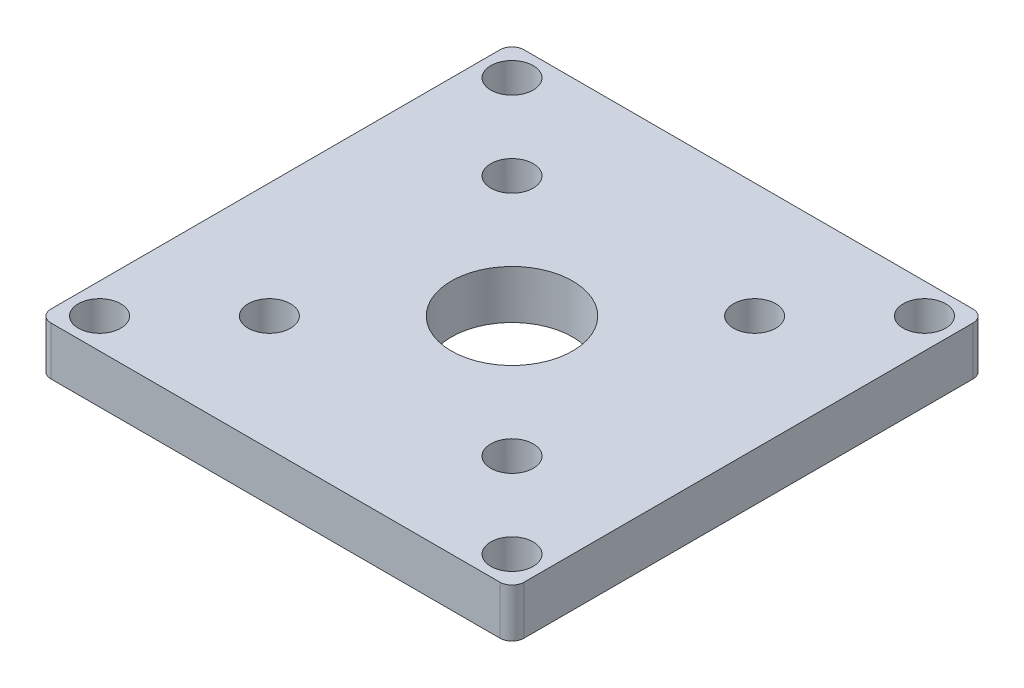
ISO-10303-21;
HEADER;
FILE_DESCRIPTION(('STEP AP214'),'2;1');
FILE_NAME('part.step','',(''),(''),'','','');
FILE_SCHEMA(('AUTOMOTIVE_DESIGN { 1 0 10303 214 1 1 1 1 }'));
ENDSEC;
DATA;
#1=APPLICATION_CONTEXT('core data for automotive mechanical design processes');
#2=APPLICATION_PROTOCOL_DEFINITION('international standard','automotive_design',2000,#1);
#3=PRODUCT_CONTEXT('',#1,'mechanical');
#4=PRODUCT('Part','Part','',(#3));
#5=PRODUCT_RELATED_PRODUCT_CATEGORY('part','',(#4));
#6=PRODUCT_DEFINITION_FORMATION('','',#4);
#7=PRODUCT_DEFINITION_CONTEXT('part definition',#1,'design');
#8=PRODUCT_DEFINITION('design','',#6,#7);
#9=PRODUCT_DEFINITION_SHAPE('','',#8);
#10=(LENGTH_UNIT() NAMED_UNIT(*) SI_UNIT(.MILLI.,.METRE.));
#11=(NAMED_UNIT(*) PLANE_ANGLE_UNIT() SI_UNIT($,.RADIAN.));
#12=(NAMED_UNIT(*) SI_UNIT($,.STERADIAN.) SOLID_ANGLE_UNIT());
#13=UNCERTAINTY_MEASURE_WITH_UNIT(LENGTH_MEASURE(1.E-05),#10,'distance_accuracy_value','');
#14=(GEOMETRIC_REPRESENTATION_CONTEXT(3) GLOBAL_UNCERTAINTY_ASSIGNED_CONTEXT((#13)) GLOBAL_UNIT_ASSIGNED_CONTEXT((#10,
#11,#12)) REPRESENTATION_CONTEXT('',''));
#15=CARTESIAN_POINT('',(0.,0.,0.));
#16=DIRECTION('',(0.,0.,1.));
#17=DIRECTION('',(1.,0.,0.));
#18=AXIS2_PLACEMENT_3D('',#15,#16,#17);
#19=CARTESIAN_POINT('',(0.,4.,0.));
#20=DIRECTION('',(0.,-1.,0.));
#21=DIRECTION('',(0.,0.,-1.));
#22=AXIS2_PLACEMENT_3D('',#19,#20,#21);
#23=PLANE('',#22);
#24=CARTESIAN_POINT('',(0.,4.,0.));
#25=DIRECTION('',(0.,1.,0.));
#26=DIRECTION('',(0.,0.,1.));
#27=AXIS2_PLACEMENT_3D('',#24,#25,#26);
#28=CIRCLE('',#27,5.);
#29=CARTESIAN_POINT('',(0.,4.,5.));
#30=VERTEX_POINT('',#29);
#31=EDGE_CURVE('E260',#30,#30,#28,.T.);
#32=ORIENTED_EDGE('',*,*,#31,.F.);
#33=EDGE_LOOP('',(#32));
#34=FACE_BOUND('',#33,.T.);
#35=CARTESIAN_POINT('',(-10.,4.,-9.99999999999917));
#36=DIRECTION('',(0.,1.,0.));
#37=DIRECTION('',(0.,0.,1.));
#38=AXIS2_PLACEMENT_3D('',#35,#36,#37);
#39=CIRCLE('',#38,1.75);
#40=CARTESIAN_POINT('',(-10.,4.,-8.24999999999917));
#41=VERTEX_POINT('',#40);
#42=EDGE_CURVE('E255',#41,#41,#39,.T.);
#43=ORIENTED_EDGE('',*,*,#42,.F.);
#44=EDGE_LOOP('',(#43));
#45=FACE_BOUND('',#44,.T.);
#46=CARTESIAN_POINT('',(-9.99999999999917,4.,10.0000000000008));
#47=DIRECTION('',(0.,1.,0.));
#48=DIRECTION('',(0.,0.,1.));
#49=AXIS2_PLACEMENT_3D('',#46,#47,#48);
#50=CIRCLE('',#49,1.75);
#51=CARTESIAN_POINT('',(-9.99999999999917,4.,11.7500000000008));
#52=VERTEX_POINT('',#51);
#53=EDGE_CURVE('E259',#52,#52,#50,.T.);
#54=ORIENTED_EDGE('',*,*,#53,.F.);
#55=EDGE_LOOP('',(#54));
#56=FACE_BOUND('',#55,.T.);
#57=CARTESIAN_POINT('',(10.0000000000008,4.,10.));
#58=DIRECTION('',(0.,1.,0.));
#59=DIRECTION('',(0.,0.,1.));
#60=AXIS2_PLACEMENT_3D('',#57,#58,#59);
#61=CIRCLE('',#60,1.75);
#62=CARTESIAN_POINT('',(10.0000000000008,4.,11.75));
#63=VERTEX_POINT('',#62);
#64=EDGE_CURVE('E254',#63,#63,#61,.T.);
#65=ORIENTED_EDGE('',*,*,#64,.F.);
#66=EDGE_LOOP('',(#65));
#67=FACE_BOUND('',#66,.T.);
#68=CARTESIAN_POINT('',(10.,4.,-10.));
#69=DIRECTION('',(0.,1.,0.));
#70=DIRECTION('',(0.,0.,1.));
#71=AXIS2_PLACEMENT_3D('',#68,#69,#70);
#72=CIRCLE('',#71,1.75);
#73=CARTESIAN_POINT('',(10.,4.,-8.25));
#74=VERTEX_POINT('',#73);
#75=EDGE_CURVE('E153',#74,#74,#72,.T.);
#76=ORIENTED_EDGE('',*,*,#75,.F.);
#77=EDGE_LOOP('',(#76));
#78=FACE_BOUND('',#77,.T.);
#79=DIRECTION('',(0.,0.,1.));
#80=VECTOR('',#79,1.);
#81=CARTESIAN_POINT('',(-19.5,4.,19.5));
#82=LINE('',#81,#80);
#83=CARTESIAN_POINT('',(-19.5,4.,-18.5));
#84=VERTEX_POINT('',#83);
#85=CARTESIAN_POINT('',(-19.5,4.,18.5));
#86=VERTEX_POINT('',#85);
#87=EDGE_CURVE('E219',#84,#86,#82,.T.);
#88=ORIENTED_EDGE('',*,*,#87,.T.);
#89=CARTESIAN_POINT('',(-18.5,4.,18.5));
#90=DIRECTION('',(0.,-1.,0.));
#91=DIRECTION('',(0.,0.,-1.));
#92=AXIS2_PLACEMENT_3D('',#89,#90,#91);
#93=CIRCLE('',#92,1.);
#94=CARTESIAN_POINT('',(-18.5,4.,19.5));
#95=VERTEX_POINT('',#94);
#96=EDGE_CURVE('E188',#86,#95,#93,.F.);
#97=ORIENTED_EDGE('',*,*,#96,.T.);
#98=DIRECTION('',(1.,0.,0.));
#99=VECTOR('',#98,1.);
#100=CARTESIAN_POINT('',(-19.5,4.,19.5));
#101=LINE('',#100,#99);
#102=CARTESIAN_POINT('',(18.5,4.,19.5));
#103=VERTEX_POINT('',#102);
#104=EDGE_CURVE('E128',#95,#103,#101,.T.);
#105=ORIENTED_EDGE('',*,*,#104,.T.);
#106=CARTESIAN_POINT('',(18.5,4.,18.5));
#107=DIRECTION('',(0.,-1.,0.));
#108=DIRECTION('',(0.,0.,-1.));
#109=AXIS2_PLACEMENT_3D('',#106,#107,#108);
#110=CIRCLE('',#109,1.);
#111=CARTESIAN_POINT('',(19.5,4.,18.5));
#112=VERTEX_POINT('',#111);
#113=EDGE_CURVE('E180',#103,#112,#110,.F.);
#114=ORIENTED_EDGE('',*,*,#113,.T.);
#115=DIRECTION('',(0.,0.,-1.));
#116=VECTOR('',#115,1.);
#117=CARTESIAN_POINT('',(19.5,4.,19.5));
#118=LINE('',#117,#116);
#119=CARTESIAN_POINT('',(19.5,4.,-18.5));
#120=VERTEX_POINT('',#119);
#121=EDGE_CURVE('E137',#112,#120,#118,.T.);
#122=ORIENTED_EDGE('',*,*,#121,.T.);
#123=CARTESIAN_POINT('',(18.5,4.,-18.5));
#124=DIRECTION('',(0.,-1.,0.));
#125=DIRECTION('',(0.,0.,-1.));
#126=AXIS2_PLACEMENT_3D('',#123,#124,#125);
#127=CIRCLE('',#126,1.);
#128=CARTESIAN_POINT('',(18.5,4.,-19.5));
#129=VERTEX_POINT('',#128);
#130=EDGE_CURVE('E63',#120,#129,#127,.F.);
#131=ORIENTED_EDGE('',*,*,#130,.T.);
#132=DIRECTION('',(-1.,0.,0.));
#133=VECTOR('',#132,1.);
#134=CARTESIAN_POINT('',(-19.5,4.,-19.5));
#135=LINE('',#134,#133);
#136=CARTESIAN_POINT('',(-18.5,4.,-19.5));
#137=VERTEX_POINT('',#136);
#138=EDGE_CURVE('E142',#129,#137,#135,.T.);
#139=ORIENTED_EDGE('',*,*,#138,.T.);
#140=CARTESIAN_POINT('',(-18.5,4.,-18.5));
#141=DIRECTION('',(0.,-1.,0.));
#142=DIRECTION('',(0.,0.,-1.));
#143=AXIS2_PLACEMENT_3D('',#140,#141,#142);
#144=CIRCLE('',#143,1.);
#145=EDGE_CURVE('E185',#137,#84,#144,.F.);
#146=ORIENTED_EDGE('',*,*,#145,.T.);
#147=EDGE_LOOP('',(#88,#97,#105,#114,#122,#131,#139,#146));
#148=FACE_BOUND('',#147,.T.);
#149=CARTESIAN_POINT('',(17.,4.,-17.));
#150=DIRECTION('',(0.,1.,0.));
#151=DIRECTION('',(0.,0.,1.));
#152=AXIS2_PLACEMENT_3D('',#149,#150,#151);
#153=CIRCLE('',#152,1.75);
#154=CARTESIAN_POINT('',(17.,4.,-15.25));
#155=VERTEX_POINT('',#154);
#156=EDGE_CURVE('E209',#155,#155,#153,.T.);
#157=ORIENTED_EDGE('',*,*,#156,.F.);
#158=EDGE_LOOP('',(#157));
#159=FACE_BOUND('',#158,.T.);
#160=CARTESIAN_POINT('',(17.0000000000012,4.,17.));
#161=DIRECTION('',(0.,1.,0.));
#162=DIRECTION('',(0.,0.,1.));
#163=AXIS2_PLACEMENT_3D('',#160,#161,#162);
#164=CIRCLE('',#163,1.75);
#165=CARTESIAN_POINT('',(17.0000000000012,4.,18.75));
#166=VERTEX_POINT('',#165);
#167=EDGE_CURVE('E227',#166,#166,#164,.T.);
#168=ORIENTED_EDGE('',*,*,#167,.F.);
#169=EDGE_LOOP('',(#168));
#170=FACE_BOUND('',#169,.T.);
#171=CARTESIAN_POINT('',(-16.9999999999988,4.,17.0000000000012));
#172=DIRECTION('',(0.,1.,0.));
#173=DIRECTION('',(0.,0.,1.));
#174=AXIS2_PLACEMENT_3D('',#171,#172,#173);
#175=CIRCLE('',#174,1.75);
#176=CARTESIAN_POINT('',(-16.9999999999988,4.,18.7500000000012));
#177=VERTEX_POINT('',#176);
#178=EDGE_CURVE('E233',#177,#177,#175,.T.);
#179=ORIENTED_EDGE('',*,*,#178,.F.);
#180=EDGE_LOOP('',(#179));
#181=FACE_BOUND('',#180,.T.);
#182=CARTESIAN_POINT('',(-17.,4.,-16.9999999999988));
#183=DIRECTION('',(0.,1.,0.));
#184=DIRECTION('',(0.,0.,1.));
#185=AXIS2_PLACEMENT_3D('',#182,#183,#184);
#186=CIRCLE('',#185,1.75);
#187=CARTESIAN_POINT('',(-17.,4.,-15.2499999999988));
#188=VERTEX_POINT('',#187);
#189=EDGE_CURVE('E241',#188,#188,#186,.T.);
#190=ORIENTED_EDGE('',*,*,#189,.F.);
#191=EDGE_LOOP('',(#190));
#192=FACE_BOUND('',#191,.T.);
#193=ADVANCED_FACE('F40',(#34,#45,#56,#67,#78,#148,#159,#170,#181,#192),#23,.F.);
#194=CARTESIAN_POINT('',(0.,0.,0.));
#195=DIRECTION('',(0.,-1.,0.));
#196=DIRECTION('',(0.,0.,-1.));
#197=AXIS2_PLACEMENT_3D('',#194,#195,#196);
#198=PLANE('',#197);
#199=CARTESIAN_POINT('',(0.,0.,0.));
#200=DIRECTION('',(0.,-1.,0.));
#201=DIRECTION('',(0.,0.,-1.));
#202=AXIS2_PLACEMENT_3D('',#199,#200,#201);
#203=CIRCLE('',#202,5.);
#204=CARTESIAN_POINT('',(0.,0.,-5.));
#205=VERTEX_POINT('',#204);
#206=EDGE_CURVE('E267',#205,#205,#203,.F.);
#207=ORIENTED_EDGE('',*,*,#206,.T.);
#208=EDGE_LOOP('',(#207));
#209=FACE_BOUND('',#208,.T.);
#210=CARTESIAN_POINT('',(-10.,0.,-9.99999999999917));
#211=DIRECTION('',(0.,-1.,0.));
#212=DIRECTION('',(0.,0.,-1.));
#213=AXIS2_PLACEMENT_3D('',#210,#211,#212);
#214=CIRCLE('',#213,1.75);
#215=CARTESIAN_POINT('',(-10.,0.,-11.7499999999992));
#216=VERTEX_POINT('',#215);
#217=EDGE_CURVE('E161',#216,#216,#214,.T.);
#218=ORIENTED_EDGE('',*,*,#217,.F.);
#219=EDGE_LOOP('',(#218));
#220=FACE_BOUND('',#219,.T.);
#221=CARTESIAN_POINT('',(-9.99999999999917,0.,10.0000000000008));
#222=DIRECTION('',(0.,-1.,0.));
#223=DIRECTION('',(0.,0.,-1.));
#224=AXIS2_PLACEMENT_3D('',#221,#222,#223);
#225=CIRCLE('',#224,1.75);
#226=CARTESIAN_POINT('',(-9.99999999999917,0.,8.25000000000083));
#227=VERTEX_POINT('',#226);
#228=EDGE_CURVE('E157',#227,#227,#225,.T.);
#229=ORIENTED_EDGE('',*,*,#228,.F.);
#230=EDGE_LOOP('',(#229));
#231=FACE_BOUND('',#230,.T.);
#232=CARTESIAN_POINT('',(10.0000000000008,0.,10.));
#233=DIRECTION('',(0.,-1.,0.));
#234=DIRECTION('',(0.,0.,-1.));
#235=AXIS2_PLACEMENT_3D('',#232,#233,#234);
#236=CIRCLE('',#235,1.75);
#237=CARTESIAN_POINT('',(10.0000000000008,0.,8.25000000000001));
#238=VERTEX_POINT('',#237);
#239=EDGE_CURVE('E152',#238,#238,#236,.T.);
#240=ORIENTED_EDGE('',*,*,#239,.F.);
#241=EDGE_LOOP('',(#240));
#242=FACE_BOUND('',#241,.T.);
#243=CARTESIAN_POINT('',(10.,0.,-10.));
#244=DIRECTION('',(0.,-1.,0.));
#245=DIRECTION('',(0.,0.,-1.));
#246=AXIS2_PLACEMENT_3D('',#243,#244,#245);
#247=CIRCLE('',#246,1.75);
#248=CARTESIAN_POINT('',(10.,0.,-11.75));
#249=VERTEX_POINT('',#248);
#250=EDGE_CURVE('E148',#249,#249,#247,.T.);
#251=ORIENTED_EDGE('',*,*,#250,.F.);
#252=EDGE_LOOP('',(#251));
#253=FACE_BOUND('',#252,.T.);
#254=CARTESIAN_POINT('',(-16.9999999999988,0.,17.0000000000012));
#255=DIRECTION('',(0.,1.,0.));
#256=DIRECTION('',(0.,0.,1.));
#257=AXIS2_PLACEMENT_3D('',#254,#255,#256);
#258=CIRCLE('',#257,1.75);
#259=CARTESIAN_POINT('',(-16.9999999999988,0.,18.7500000000012));
#260=VERTEX_POINT('',#259);
#261=EDGE_CURVE('E237',#260,#260,#258,.T.);
#262=ORIENTED_EDGE('',*,*,#261,.T.);
#263=EDGE_LOOP('',(#262));
#264=FACE_BOUND('',#263,.T.);
#265=CARTESIAN_POINT('',(17.,0.,-17.));
#266=DIRECTION('',(0.,1.,0.));
#267=DIRECTION('',(0.,0.,1.));
#268=AXIS2_PLACEMENT_3D('',#265,#266,#267);
#269=CIRCLE('',#268,1.75);
#270=CARTESIAN_POINT('',(17.,0.,-15.25));
#271=VERTEX_POINT('',#270);
#272=EDGE_CURVE('E214',#271,#271,#269,.T.);
#273=ORIENTED_EDGE('',*,*,#272,.T.);
#274=EDGE_LOOP('',(#273));
#275=FACE_BOUND('',#274,.T.);
#276=DIRECTION('',(1.,0.,0.));
#277=VECTOR('',#276,1.);
#278=CARTESIAN_POINT('',(-19.5,0.,19.5));
#279=LINE('',#278,#277);
#280=CARTESIAN_POINT('',(-18.5,0.,19.5));
#281=VERTEX_POINT('',#280);
#282=CARTESIAN_POINT('',(18.5,0.,19.5));
#283=VERTEX_POINT('',#282);
#284=EDGE_CURVE('E125',#281,#283,#279,.T.);
#285=ORIENTED_EDGE('',*,*,#284,.F.);
#286=CARTESIAN_POINT('',(-18.5,0.,18.5));
#287=DIRECTION('',(0.,-1.,0.));
#288=DIRECTION('',(0.,0.,-1.));
#289=AXIS2_PLACEMENT_3D('',#286,#287,#288);
#290=CIRCLE('',#289,1.);
#291=CARTESIAN_POINT('',(-19.5,0.,18.5));
#292=VERTEX_POINT('',#291);
#293=EDGE_CURVE('E107',#281,#292,#290,.T.);
#294=ORIENTED_EDGE('',*,*,#293,.T.);
#295=DIRECTION('',(0.,0.,1.));
#296=VECTOR('',#295,1.);
#297=CARTESIAN_POINT('',(-19.5,0.,19.5));
#298=LINE('',#297,#296);
#299=CARTESIAN_POINT('',(-19.5,0.,-18.5));
#300=VERTEX_POINT('',#299);
#301=EDGE_CURVE('E138',#300,#292,#298,.T.);
#302=ORIENTED_EDGE('',*,*,#301,.F.);
#303=CARTESIAN_POINT('',(-18.5,0.,-18.5));
#304=DIRECTION('',(0.,-1.,0.));
#305=DIRECTION('',(0.,0.,-1.));
#306=AXIS2_PLACEMENT_3D('',#303,#304,#305);
#307=CIRCLE('',#306,1.);
#308=CARTESIAN_POINT('',(-18.5,0.,-19.5));
#309=VERTEX_POINT('',#308);
#310=EDGE_CURVE('E119',#300,#309,#307,.T.);
#311=ORIENTED_EDGE('',*,*,#310,.T.);
#312=DIRECTION('',(-1.,0.,0.));
#313=VECTOR('',#312,1.);
#314=CARTESIAN_POINT('',(-19.5,0.,-19.5));
#315=LINE('',#314,#313);
#316=CARTESIAN_POINT('',(18.5,0.,-19.5));
#317=VERTEX_POINT('',#316);
#318=EDGE_CURVE('E144',#317,#309,#315,.T.);
#319=ORIENTED_EDGE('',*,*,#318,.F.);
#320=CARTESIAN_POINT('',(18.5,0.,-18.5));
#321=DIRECTION('',(0.,-1.,0.));
#322=DIRECTION('',(0.,0.,-1.));
#323=AXIS2_PLACEMENT_3D('',#320,#321,#322);
#324=CIRCLE('',#323,1.);
#325=CARTESIAN_POINT('',(19.5,0.,-18.5));
#326=VERTEX_POINT('',#325);
#327=EDGE_CURVE('E170',#317,#326,#324,.T.);
#328=ORIENTED_EDGE('',*,*,#327,.T.);
#329=DIRECTION('',(0.,0.,-1.));
#330=VECTOR('',#329,1.);
#331=CARTESIAN_POINT('',(19.5,0.,19.5));
#332=LINE('',#331,#330);
#333=CARTESIAN_POINT('',(19.5,0.,18.5));
#334=VERTEX_POINT('',#333);
#335=EDGE_CURVE('E203',#334,#326,#332,.T.);
#336=ORIENTED_EDGE('',*,*,#335,.F.);
#337=CARTESIAN_POINT('',(18.5,0.,18.5));
#338=DIRECTION('',(0.,-1.,0.));
#339=DIRECTION('',(0.,0.,-1.));
#340=AXIS2_PLACEMENT_3D('',#337,#338,#339);
#341=CIRCLE('',#340,1.);
#342=EDGE_CURVE('E130',#334,#283,#341,.T.);
#343=ORIENTED_EDGE('',*,*,#342,.T.);
#344=EDGE_LOOP('',(#285,#294,#302,#311,#319,#328,#336,#343));
#345=FACE_BOUND('',#344,.T.);
#346=CARTESIAN_POINT('',(17.0000000000012,0.,17.));
#347=DIRECTION('',(0.,1.,0.));
#348=DIRECTION('',(0.,0.,1.));
#349=AXIS2_PLACEMENT_3D('',#346,#347,#348);
#350=CIRCLE('',#349,1.75);
#351=CARTESIAN_POINT('',(17.0000000000012,0.,18.75));
#352=VERTEX_POINT('',#351);
#353=EDGE_CURVE('E229',#352,#352,#350,.T.);
#354=ORIENTED_EDGE('',*,*,#353,.T.);
#355=EDGE_LOOP('',(#354));
#356=FACE_BOUND('',#355,.T.);
#357=CARTESIAN_POINT('',(-17.,0.,-16.9999999999988));
#358=DIRECTION('',(0.,1.,0.));
#359=DIRECTION('',(0.,0.,1.));
#360=AXIS2_PLACEMENT_3D('',#357,#358,#359);
#361=CIRCLE('',#360,1.75);
#362=CARTESIAN_POINT('',(-17.,0.,-15.2499999999988));
#363=VERTEX_POINT('',#362);
#364=EDGE_CURVE('E165',#363,#363,#361,.T.);
#365=ORIENTED_EDGE('',*,*,#364,.T.);
#366=EDGE_LOOP('',(#365));
#367=FACE_BOUND('',#366,.T.);
#368=ADVANCED_FACE('F133',(#209,#220,#231,#242,#253,#264,#275,#345,#356,#367),#198,.T.);
#369=CARTESIAN_POINT('',(19.5,4.,19.5));
#370=DIRECTION('',(-1.,0.,0.));
#371=DIRECTION('',(0.,0.,1.));
#372=AXIS2_PLACEMENT_3D('',#369,#370,#371);
#373=PLANE('',#372);
#374=ORIENTED_EDGE('',*,*,#335,.T.);
#375=DIRECTION('',(0.,-1.,0.));
#376=VECTOR('',#375,1.);
#377=CARTESIAN_POINT('',(19.5,4.,-18.5));
#378=LINE('',#377,#376);
#379=EDGE_CURVE('E11',#326,#120,#378,.F.);
#380=ORIENTED_EDGE('',*,*,#379,.T.);
#381=ORIENTED_EDGE('',*,*,#121,.F.);
#382=DIRECTION('',(0.,-1.,0.));
#383=VECTOR('',#382,1.);
#384=CARTESIAN_POINT('',(19.5,4.,18.5));
#385=LINE('',#384,#383);
#386=EDGE_CURVE('E49',#112,#334,#385,.T.);
#387=ORIENTED_EDGE('',*,*,#386,.T.);
#388=EDGE_LOOP('',(#374,#380,#381,#387));
#389=FACE_BOUND('',#388,.T.);
#390=ADVANCED_FACE('F202',(#389),#373,.F.);
#391=CARTESIAN_POINT('',(-19.5,4.,-19.5));
#392=DIRECTION('',(0.,0.,1.));
#393=DIRECTION('',(1.,0.,0.));
#394=AXIS2_PLACEMENT_3D('',#391,#392,#393);
#395=PLANE('',#394);
#396=ORIENTED_EDGE('',*,*,#318,.T.);
#397=DIRECTION('',(0.,-1.,0.));
#398=VECTOR('',#397,1.);
#399=CARTESIAN_POINT('',(-18.5,4.,-19.5));
#400=LINE('',#399,#398);
#401=EDGE_CURVE('E56',#309,#137,#400,.F.);
#402=ORIENTED_EDGE('',*,*,#401,.T.);
#403=ORIENTED_EDGE('',*,*,#138,.F.);
#404=DIRECTION('',(0.,-1.,0.));
#405=VECTOR('',#404,1.);
#406=CARTESIAN_POINT('',(18.5,4.,-19.5));
#407=LINE('',#406,#405);
#408=EDGE_CURVE('E191',#129,#317,#407,.T.);
#409=ORIENTED_EDGE('',*,*,#408,.T.);
#410=EDGE_LOOP('',(#396,#402,#403,#409));
#411=FACE_BOUND('',#410,.T.);
#412=ADVANCED_FACE('F312',(#411),#395,.F.);
#413=CARTESIAN_POINT('',(-19.5,4.,19.5));
#414=DIRECTION('',(1.,0.,0.));
#415=DIRECTION('',(0.,0.,-1.));
#416=AXIS2_PLACEMENT_3D('',#413,#414,#415);
#417=PLANE('',#416);
#418=ORIENTED_EDGE('',*,*,#301,.T.);
#419=DIRECTION('',(0.,-1.,0.));
#420=VECTOR('',#419,1.);
#421=CARTESIAN_POINT('',(-19.5,4.,18.5));
#422=LINE('',#421,#420);
#423=EDGE_CURVE('E112',#292,#86,#422,.F.);
#424=ORIENTED_EDGE('',*,*,#423,.T.);
#425=ORIENTED_EDGE('',*,*,#87,.F.);
#426=DIRECTION('',(0.,-1.,0.));
#427=VECTOR('',#426,1.);
#428=CARTESIAN_POINT('',(-19.5,4.,-18.5));
#429=LINE('',#428,#427);
#430=EDGE_CURVE('E118',#84,#300,#429,.T.);
#431=ORIENTED_EDGE('',*,*,#430,.T.);
#432=EDGE_LOOP('',(#418,#424,#425,#431));
#433=FACE_BOUND('',#432,.T.);
#434=ADVANCED_FACE('F320',(#433),#417,.F.);
#435=CARTESIAN_POINT('',(-19.5,4.,19.5));
#436=DIRECTION('',(0.,0.,-1.));
#437=DIRECTION('',(-1.,0.,0.));
#438=AXIS2_PLACEMENT_3D('',#435,#436,#437);
#439=PLANE('',#438);
#440=ORIENTED_EDGE('',*,*,#104,.F.);
#441=DIRECTION('',(0.,-1.,0.));
#442=VECTOR('',#441,1.);
#443=CARTESIAN_POINT('',(-18.5,4.,19.5));
#444=LINE('',#443,#442);
#445=EDGE_CURVE('E111',#95,#281,#444,.T.);
#446=ORIENTED_EDGE('',*,*,#445,.T.);
#447=ORIENTED_EDGE('',*,*,#284,.T.);
#448=DIRECTION('',(0.,-1.,0.));
#449=VECTOR('',#448,1.);
#450=CARTESIAN_POINT('',(18.5,4.,19.5));
#451=LINE('',#450,#449);
#452=EDGE_CURVE('E131',#283,#103,#451,.F.);
#453=ORIENTED_EDGE('',*,*,#452,.T.);
#454=EDGE_LOOP('',(#440,#446,#447,#453));
#455=FACE_BOUND('',#454,.T.);
#456=ADVANCED_FACE('F124',(#455),#439,.F.);
#457=CARTESIAN_POINT('',(17.,4.,-17.));
#458=DIRECTION('',(0.,-1.,0.));
#459=DIRECTION('',(0.,0.,-1.));
#460=AXIS2_PLACEMENT_3D('',#457,#458,#459);
#461=CYLINDRICAL_SURFACE('',#460,1.75);
#462=ORIENTED_EDGE('',*,*,#156,.T.);
#463=EDGE_LOOP('',(#462));
#464=FACE_BOUND('',#463,.T.);
#465=ORIENTED_EDGE('',*,*,#272,.F.);
#466=EDGE_LOOP('',(#465));
#467=FACE_BOUND('',#466,.T.);
#468=ADVANCED_FACE('F319',(#464,#467),#461,.F.);
#469=CARTESIAN_POINT('',(17.0000000000012,4.,17.));
#470=DIRECTION('',(0.,-1.,0.));
#471=DIRECTION('',(0.,0.,-1.));
#472=AXIS2_PLACEMENT_3D('',#469,#470,#471);
#473=CYLINDRICAL_SURFACE('',#472,1.75);
#474=ORIENTED_EDGE('',*,*,#167,.T.);
#475=EDGE_LOOP('',(#474));
#476=FACE_BOUND('',#475,.T.);
#477=ORIENTED_EDGE('',*,*,#353,.F.);
#478=EDGE_LOOP('',(#477));
#479=FACE_BOUND('',#478,.T.);
#480=ADVANCED_FACE('F365',(#476,#479),#473,.F.);
#481=CARTESIAN_POINT('',(-16.9999999999988,4.,17.0000000000012));
#482=DIRECTION('',(0.,-1.,0.));
#483=DIRECTION('',(0.,0.,-1.));
#484=AXIS2_PLACEMENT_3D('',#481,#482,#483);
#485=CYLINDRICAL_SURFACE('',#484,1.75);
#486=ORIENTED_EDGE('',*,*,#178,.T.);
#487=EDGE_LOOP('',(#486));
#488=FACE_BOUND('',#487,.T.);
#489=ORIENTED_EDGE('',*,*,#261,.F.);
#490=EDGE_LOOP('',(#489));
#491=FACE_BOUND('',#490,.T.);
#492=ADVANCED_FACE('F301',(#488,#491),#485,.F.);
#493=CARTESIAN_POINT('',(-17.,4.,-16.9999999999988));
#494=DIRECTION('',(0.,-1.,0.));
#495=DIRECTION('',(0.,0.,-1.));
#496=AXIS2_PLACEMENT_3D('',#493,#494,#495);
#497=CYLINDRICAL_SURFACE('',#496,1.75);
#498=ORIENTED_EDGE('',*,*,#189,.T.);
#499=EDGE_LOOP('',(#498));
#500=FACE_BOUND('',#499,.T.);
#501=ORIENTED_EDGE('',*,*,#364,.F.);
#502=EDGE_LOOP('',(#501));
#503=FACE_BOUND('',#502,.T.);
#504=ADVANCED_FACE('F297',(#500,#503),#497,.F.);
#505=CARTESIAN_POINT('',(10.,-7.,-10.));
#506=DIRECTION('',(0.,1.,0.));
#507=DIRECTION('',(0.,0.,1.));
#508=AXIS2_PLACEMENT_3D('',#505,#506,#507);
#509=CYLINDRICAL_SURFACE('',#508,1.75);
#510=ORIENTED_EDGE('',*,*,#250,.T.);
#511=EDGE_LOOP('',(#510));
#512=FACE_BOUND('',#511,.T.);
#513=ORIENTED_EDGE('',*,*,#75,.T.);
#514=EDGE_LOOP('',(#513));
#515=FACE_BOUND('',#514,.T.);
#516=ADVANCED_FACE('F300',(#512,#515),#509,.F.);
#517=CARTESIAN_POINT('',(10.0000000000008,-7.,10.));
#518=DIRECTION('',(0.,1.,0.));
#519=DIRECTION('',(0.,0.,1.));
#520=AXIS2_PLACEMENT_3D('',#517,#518,#519);
#521=CYLINDRICAL_SURFACE('',#520,1.75);
#522=ORIENTED_EDGE('',*,*,#239,.T.);
#523=EDGE_LOOP('',(#522));
#524=FACE_BOUND('',#523,.T.);
#525=ORIENTED_EDGE('',*,*,#64,.T.);
#526=EDGE_LOOP('',(#525));
#527=FACE_BOUND('',#526,.T.);
#528=ADVANCED_FACE('F349',(#524,#527),#521,.F.);
#529=CARTESIAN_POINT('',(-9.99999999999917,-7.,10.0000000000008));
#530=DIRECTION('',(0.,1.,0.));
#531=DIRECTION('',(0.,0.,1.));
#532=AXIS2_PLACEMENT_3D('',#529,#530,#531);
#533=CYLINDRICAL_SURFACE('',#532,1.75);
#534=ORIENTED_EDGE('',*,*,#228,.T.);
#535=EDGE_LOOP('',(#534));
#536=FACE_BOUND('',#535,.T.);
#537=ORIENTED_EDGE('',*,*,#53,.T.);
#538=EDGE_LOOP('',(#537));
#539=FACE_BOUND('',#538,.T.);
#540=ADVANCED_FACE('F352',(#536,#539),#533,.F.);
#541=CARTESIAN_POINT('',(-10.,-7.,-9.99999999999917));
#542=DIRECTION('',(0.,1.,0.));
#543=DIRECTION('',(0.,0.,1.));
#544=AXIS2_PLACEMENT_3D('',#541,#542,#543);
#545=CYLINDRICAL_SURFACE('',#544,1.75);
#546=ORIENTED_EDGE('',*,*,#217,.T.);
#547=EDGE_LOOP('',(#546));
#548=FACE_BOUND('',#547,.T.);
#549=ORIENTED_EDGE('',*,*,#42,.T.);
#550=EDGE_LOOP('',(#549));
#551=FACE_BOUND('',#550,.T.);
#552=ADVANCED_FACE('F329',(#548,#551),#545,.F.);
#553=CARTESIAN_POINT('',(-18.5,4.,18.5));
#554=DIRECTION('',(0.,-1.,0.));
#555=DIRECTION('',(0.,0.,-1.));
#556=AXIS2_PLACEMENT_3D('',#553,#554,#555);
#557=CYLINDRICAL_SURFACE('',#556,1.);
#558=ORIENTED_EDGE('',*,*,#96,.F.);
#559=ORIENTED_EDGE('',*,*,#423,.F.);
#560=ORIENTED_EDGE('',*,*,#293,.F.);
#561=ORIENTED_EDGE('',*,*,#445,.F.);
#562=EDGE_LOOP('',(#558,#559,#560,#561));
#563=FACE_BOUND('',#562,.T.);
#564=ADVANCED_FACE('F110',(#563),#557,.T.);
#565=CARTESIAN_POINT('',(-18.5,4.,-18.5));
#566=DIRECTION('',(0.,-1.,0.));
#567=DIRECTION('',(0.,0.,-1.));
#568=AXIS2_PLACEMENT_3D('',#565,#566,#567);
#569=CYLINDRICAL_SURFACE('',#568,1.);
#570=ORIENTED_EDGE('',*,*,#145,.F.);
#571=ORIENTED_EDGE('',*,*,#401,.F.);
#572=ORIENTED_EDGE('',*,*,#310,.F.);
#573=ORIENTED_EDGE('',*,*,#430,.F.);
#574=EDGE_LOOP('',(#570,#571,#572,#573));
#575=FACE_BOUND('',#574,.T.);
#576=ADVANCED_FACE('F328',(#575),#569,.T.);
#577=CARTESIAN_POINT('',(18.5,4.,-18.5));
#578=DIRECTION('',(0.,-1.,0.));
#579=DIRECTION('',(0.,0.,-1.));
#580=AXIS2_PLACEMENT_3D('',#577,#578,#579);
#581=CYLINDRICAL_SURFACE('',#580,1.);
#582=ORIENTED_EDGE('',*,*,#130,.F.);
#583=ORIENTED_EDGE('',*,*,#379,.F.);
#584=ORIENTED_EDGE('',*,*,#327,.F.);
#585=ORIENTED_EDGE('',*,*,#408,.F.);
#586=EDGE_LOOP('',(#582,#583,#584,#585));
#587=FACE_BOUND('',#586,.T.);
#588=ADVANCED_FACE('F331',(#587),#581,.T.);
#589=CARTESIAN_POINT('',(18.5,4.,18.5));
#590=DIRECTION('',(0.,-1.,0.));
#591=DIRECTION('',(0.,0.,-1.));
#592=AXIS2_PLACEMENT_3D('',#589,#590,#591);
#593=CYLINDRICAL_SURFACE('',#592,1.);
#594=ORIENTED_EDGE('',*,*,#113,.F.);
#595=ORIENTED_EDGE('',*,*,#452,.F.);
#596=ORIENTED_EDGE('',*,*,#342,.F.);
#597=ORIENTED_EDGE('',*,*,#386,.F.);
#598=EDGE_LOOP('',(#594,#595,#596,#597));
#599=FACE_BOUND('',#598,.T.);
#600=ADVANCED_FACE('F42',(#599),#593,.T.);
#601=CARTESIAN_POINT('',(0.,-0.00100000000000013,0.));
#602=DIRECTION('',(0.,1.,0.));
#603=DIRECTION('',(0.,0.,1.));
#604=AXIS2_PLACEMENT_3D('',#601,#602,#603);
#605=CYLINDRICAL_SURFACE('',#604,5.);
#606=ORIENTED_EDGE('',*,*,#206,.F.);
#607=EDGE_LOOP('',(#606));
#608=FACE_BOUND('',#607,.T.);
#609=ORIENTED_EDGE('',*,*,#31,.T.);
#610=EDGE_LOOP('',(#609));
#611=FACE_BOUND('',#610,.T.);
#612=ADVANCED_FACE('F275',(#608,#611),#605,.F.);
#613=CLOSED_SHELL('',(#193,#368,#390,#412,#434,#456,#468,#480,#492,#504,#516,#528,#540,#552,
#564,#576,#588,#600,#612));
#614=MANIFOLD_SOLID_BREP('B2',#613);
#615=ADVANCED_BREP_SHAPE_REPRESENTATION('',(#18,#614),#14);
#616=SHAPE_DEFINITION_REPRESENTATION(#9,#615);
ENDSEC;
END-ISO-10303-21;
